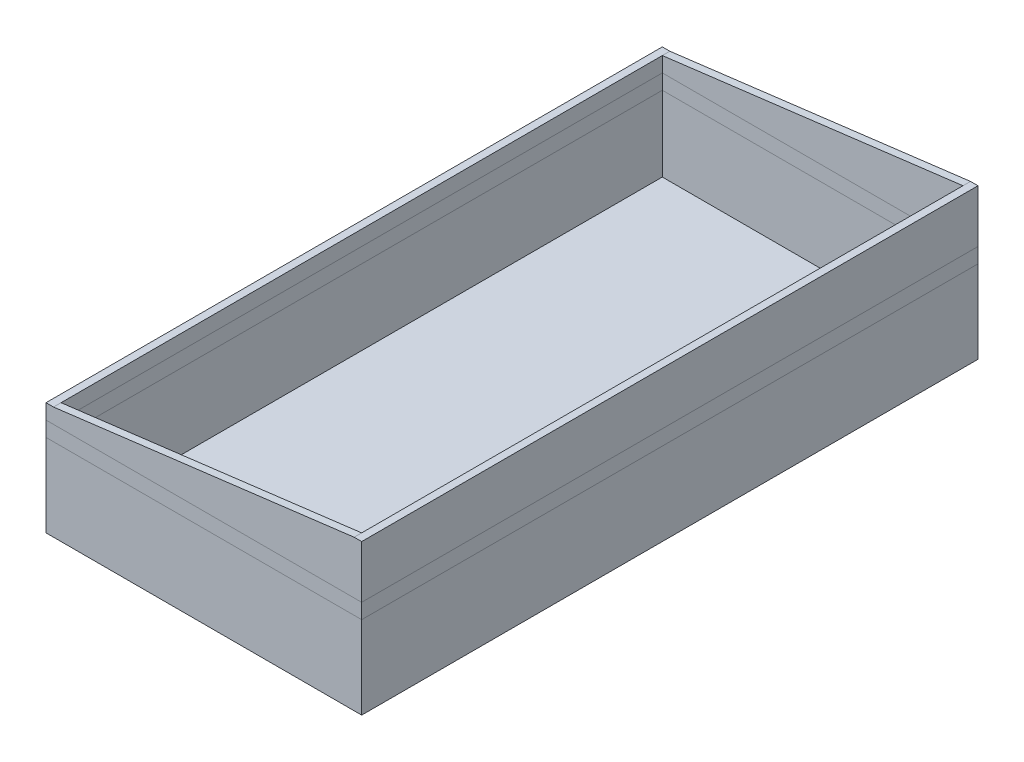
ISO-10303-21;
HEADER;
FILE_DESCRIPTION(('STEP AP214'),'2;1');
FILE_NAME('part.step','',(''),(''),'','','');
FILE_SCHEMA(('AUTOMOTIVE_DESIGN { 1 0 10303 214 1 1 1 1 }'));
ENDSEC;
DATA;
#1=APPLICATION_CONTEXT('core data for automotive mechanical design processes');
#2=APPLICATION_PROTOCOL_DEFINITION('international standard','automotive_design',2000,#1);
#3=PRODUCT_CONTEXT('',#1,'mechanical');
#4=PRODUCT('Part','Part','',(#3));
#5=PRODUCT_RELATED_PRODUCT_CATEGORY('part','',(#4));
#6=PRODUCT_DEFINITION_FORMATION('','',#4);
#7=PRODUCT_DEFINITION_CONTEXT('part definition',#1,'design');
#8=PRODUCT_DEFINITION('design','',#6,#7);
#9=PRODUCT_DEFINITION_SHAPE('','',#8);
#10=(LENGTH_UNIT() NAMED_UNIT(*) SI_UNIT(.MILLI.,.METRE.));
#11=(NAMED_UNIT(*) PLANE_ANGLE_UNIT() SI_UNIT($,.RADIAN.));
#12=(NAMED_UNIT(*) SI_UNIT($,.STERADIAN.) SOLID_ANGLE_UNIT());
#13=UNCERTAINTY_MEASURE_WITH_UNIT(LENGTH_MEASURE(1.E-05),#10,'distance_accuracy_value','');
#14=(GEOMETRIC_REPRESENTATION_CONTEXT(3) GLOBAL_UNCERTAINTY_ASSIGNED_CONTEXT((#13)) GLOBAL_UNIT_ASSIGNED_CONTEXT((#10,
#11,#12)) REPRESENTATION_CONTEXT('',''));
#15=CARTESIAN_POINT('',(0.,0.,0.));
#16=DIRECTION('',(0.,0.,1.));
#17=DIRECTION('',(1.,0.,0.));
#18=AXIS2_PLACEMENT_3D('',#15,#16,#17);
#19=CARTESIAN_POINT('',(-105.,0.,200.));
#20=DIRECTION('',(0.,0.,1.));
#21=DIRECTION('',(1.,0.,0.));
#22=AXIS2_PLACEMENT_3D('',#19,#20,#21);
#23=PLANE('',#22);
#24=DIRECTION('',(0.,1.,0.));
#25=VECTOR('',#24,1.);
#26=CARTESIAN_POINT('',(-100.,0.,200.));
#27=LINE('',#26,#25);
#28=CARTESIAN_POINT('',(-100.,65.,200.));
#29=VERTEX_POINT('',#28);
#30=CARTESIAN_POINT('',(-100.,75.,200.));
#31=VERTEX_POINT('',#30);
#32=EDGE_CURVE('P0_E20',#29,#31,#27,.T.);
#33=ORIENTED_EDGE('',*,*,#32,.T.);
#34=DIRECTION('',(0.992277876713668,0.124034734589208,0.));
#35=VECTOR('',#34,1.);
#36=CARTESIAN_POINT('',(100.,100.,200.));
#37=LINE('',#36,#35);
#38=CARTESIAN_POINT('',(100.,100.,200.));
#39=VERTEX_POINT('',#38);
#40=EDGE_CURVE('P0_E115',#31,#39,#37,.T.);
#41=ORIENTED_EDGE('',*,*,#40,.T.);
#42=DIRECTION('',(0.,1.,0.));
#43=VECTOR('',#42,1.);
#44=CARTESIAN_POINT('',(100.,0.,200.));
#45=LINE('',#44,#43);
#46=CARTESIAN_POINT('',(100.,65.,200.));
#47=VERTEX_POINT('',#46);
#48=EDGE_CURVE('P0_E133',#39,#47,#45,.F.);
#49=ORIENTED_EDGE('',*,*,#48,.T.);
#50=DIRECTION('',(1.,0.,0.));
#51=VECTOR('',#50,1.);
#52=CARTESIAN_POINT('',(-105.,65.,200.));
#53=LINE('',#52,#51);
#54=EDGE_CURVE('P0_E138',#29,#47,#53,.T.);
#55=ORIENTED_EDGE('',*,*,#54,.F.);
#56=EDGE_LOOP('',(#33,#41,#49,#55));
#57=FACE_BOUND('',#56,.T.);
#58=ADVANCED_FACE('P0_F17',(#57),#23,.F.);
#59=CARTESIAN_POINT('',(105.,0.,-200.));
#60=DIRECTION('',(0.,0.,-1.));
#61=DIRECTION('',(-1.,0.,0.));
#62=AXIS2_PLACEMENT_3D('',#59,#60,#61);
#63=PLANE('',#62);
#64=DIRECTION('',(0.,1.,0.));
#65=VECTOR('',#64,1.);
#66=CARTESIAN_POINT('',(100.,0.,-200.));
#67=LINE('',#66,#65);
#68=CARTESIAN_POINT('',(100.,65.,-200.));
#69=VERTEX_POINT('',#68);
#70=CARTESIAN_POINT('',(100.,100.,-200.));
#71=VERTEX_POINT('',#70);
#72=EDGE_CURVE('P0_E101',#69,#71,#67,.T.);
#73=ORIENTED_EDGE('',*,*,#72,.T.);
#74=DIRECTION('',(0.992277876713668,0.124034734589208,0.));
#75=VECTOR('',#74,1.);
#76=CARTESIAN_POINT('',(100.,100.,-200.));
#77=LINE('',#76,#75);
#78=CARTESIAN_POINT('',(-100.,75.,-200.));
#79=VERTEX_POINT('',#78);
#80=EDGE_CURVE('P0_E94',#71,#79,#77,.F.);
#81=ORIENTED_EDGE('',*,*,#80,.T.);
#82=DIRECTION('',(0.,1.,0.));
#83=VECTOR('',#82,1.);
#84=CARTESIAN_POINT('',(-100.,0.,-200.));
#85=LINE('',#84,#83);
#86=CARTESIAN_POINT('',(-100.,65.,-200.));
#87=VERTEX_POINT('',#86);
#88=EDGE_CURVE('P0_E99',#79,#87,#85,.F.);
#89=ORIENTED_EDGE('',*,*,#88,.T.);
#90=DIRECTION('',(1.,0.,0.));
#91=VECTOR('',#90,1.);
#92=CARTESIAN_POINT('',(-105.,65.,-200.));
#93=LINE('',#92,#91);
#94=EDGE_CURVE('P0_E145',#69,#87,#93,.F.);
#95=ORIENTED_EDGE('',*,*,#94,.F.);
#96=EDGE_LOOP('',(#73,#81,#89,#95));
#97=FACE_BOUND('',#96,.T.);
#98=ADVANCED_FACE('P0_F96',(#97),#63,.F.);
#99=CARTESIAN_POINT('',(-100.,0.,-205.));
#100=DIRECTION('',(-1.,0.,0.));
#101=DIRECTION('',(0.,0.,1.));
#102=AXIS2_PLACEMENT_3D('',#99,#100,#101);
#103=PLANE('',#102);
#104=ORIENTED_EDGE('',*,*,#88,.F.);
#105=DIRECTION('',(0.,0.,-1.));
#106=VECTOR('',#105,1.);
#107=CARTESIAN_POINT('',(-100.,75.,205.));
#108=LINE('',#107,#106);
#109=EDGE_CURVE('P0_E114',#79,#31,#108,.F.);
#110=ORIENTED_EDGE('',*,*,#109,.T.);
#111=ORIENTED_EDGE('',*,*,#32,.F.);
#112=DIRECTION('',(0.,0.,-1.));
#113=VECTOR('',#112,1.);
#114=CARTESIAN_POINT('',(-100.,65.,-205.001));
#115=LINE('',#114,#113);
#116=EDGE_CURVE('P0_E121',#87,#29,#115,.F.);
#117=ORIENTED_EDGE('',*,*,#116,.F.);
#118=EDGE_LOOP('',(#104,#110,#111,#117));
#119=FACE_BOUND('',#118,.T.);
#120=ADVANCED_FACE('P0_F118',(#119),#103,.F.);
#121=CARTESIAN_POINT('',(100.,100.,205.));
#122=DIRECTION('',(0.124034734589208,-0.992277876713668,0.));
#123=DIRECTION('',(0.992277876713668,0.124034734589208,0.));
#124=AXIS2_PLACEMENT_3D('',#121,#122,#123);
#125=PLANE('',#124);
#126=DIRECTION('',(0.,0.,-1.));
#127=VECTOR('',#126,1.);
#128=CARTESIAN_POINT('',(-100.,75.,205.));
#129=LINE('',#128,#127);
#130=CARTESIAN_POINT('',(-100.000000000001,75.,-205.));
#131=VERTEX_POINT('',#130);
#132=EDGE_CURVE('P0_E106',#131,#79,#129,.F.);
#133=ORIENTED_EDGE('',*,*,#132,.T.);
#134=ORIENTED_EDGE('',*,*,#80,.F.);
#135=DIRECTION('',(0.,0.,1.));
#136=VECTOR('',#135,1.);
#137=CARTESIAN_POINT('',(100.,100.,0.));
#138=LINE('',#137,#136);
#139=CARTESIAN_POINT('',(100.,100.,-205.));
#140=VERTEX_POINT('',#139);
#141=EDGE_CURVE('P0_E174',#140,#71,#138,.T.);
#142=ORIENTED_EDGE('',*,*,#141,.F.);
#143=DIRECTION('',(0.992277876713668,0.124034734589208,0.));
#144=VECTOR('',#143,1.);
#145=CARTESIAN_POINT('',(-100.,75.,-205.));
#146=LINE('',#145,#144);
#147=EDGE_CURVE('P0_E109',#131,#140,#146,.T.);
#148=ORIENTED_EDGE('',*,*,#147,.F.);
#149=EDGE_LOOP('',(#133,#134,#142,#148));
#150=FACE_BOUND('',#149,.T.);
#151=ADVANCED_FACE('P0_F107',(#150),#125,.F.);
#152=CARTESIAN_POINT('',(100.,0.,205.));
#153=DIRECTION('',(1.,0.,0.));
#154=DIRECTION('',(0.,0.,-1.));
#155=AXIS2_PLACEMENT_3D('',#152,#153,#154);
#156=PLANE('',#155);
#157=ORIENTED_EDGE('',*,*,#48,.F.);
#158=DIRECTION('',(0.,0.,1.));
#159=VECTOR('',#158,1.);
#160=CARTESIAN_POINT('',(100.,100.,0.));
#161=LINE('',#160,#159);
#162=EDGE_CURVE('P0_E177',#71,#39,#161,.T.);
#163=ORIENTED_EDGE('',*,*,#162,.F.);
#164=ORIENTED_EDGE('',*,*,#72,.F.);
#165=DIRECTION('',(0.,0.,-1.));
#166=VECTOR('',#165,1.);
#167=CARTESIAN_POINT('',(100.,65.,-205.001));
#168=LINE('',#167,#166);
#169=EDGE_CURVE('P0_E142',#47,#69,#168,.T.);
#170=ORIENTED_EDGE('',*,*,#169,.F.);
#171=EDGE_LOOP('',(#157,#163,#164,#170));
#172=FACE_BOUND('',#171,.T.);
#173=ADVANCED_FACE('P0_F143',(#172),#156,.F.);
#174=CARTESIAN_POINT('',(100.,100.,205.));
#175=DIRECTION('',(0.124034734589208,-0.992277876713668,0.));
#176=DIRECTION('',(0.992277876713668,0.124034734589208,0.));
#177=AXIS2_PLACEMENT_3D('',#174,#175,#176);
#178=PLANE('',#177);
#179=DIRECTION('',(0.,0.,-1.));
#180=VECTOR('',#179,1.);
#181=CARTESIAN_POINT('',(-100.,75.,205.));
#182=LINE('',#181,#180);
#183=CARTESIAN_POINT('',(-100.,75.,205.));
#184=VERTEX_POINT('',#183);
#185=EDGE_CURVE('P0_E126',#31,#184,#182,.F.);
#186=ORIENTED_EDGE('',*,*,#185,.T.);
#187=DIRECTION('',(-0.992277876713668,-0.124034734589208,0.));
#188=VECTOR('',#187,1.);
#189=CARTESIAN_POINT('',(100.,100.,205.));
#190=LINE('',#189,#188);
#191=CARTESIAN_POINT('',(100.000000000001,100.,205.));
#192=VERTEX_POINT('',#191);
#193=EDGE_CURVE('P0_E189',#192,#184,#190,.T.);
#194=ORIENTED_EDGE('',*,*,#193,.F.);
#195=DIRECTION('',(0.,0.,1.));
#196=VECTOR('',#195,1.);
#197=CARTESIAN_POINT('',(100.,100.,0.));
#198=LINE('',#197,#196);
#199=EDGE_CURVE('P0_E180',#39,#192,#198,.T.);
#200=ORIENTED_EDGE('',*,*,#199,.F.);
#201=ORIENTED_EDGE('',*,*,#40,.F.);
#202=EDGE_LOOP('',(#186,#194,#200,#201));
#203=FACE_BOUND('',#202,.T.);
#204=ADVANCED_FACE('P0_F210',(#203),#178,.F.);
#205=CARTESIAN_POINT('',(-100.,75.,205.));
#206=DIRECTION('',(0.,-1.,0.));
#207=DIRECTION('',(0.,0.,-1.));
#208=AXIS2_PLACEMENT_3D('',#205,#206,#207);
#209=PLANE('',#208);
#210=DIRECTION('',(0.,0.,1.));
#211=VECTOR('',#210,1.);
#212=CARTESIAN_POINT('',(-105.,75.,-205.));
#213=LINE('',#212,#211);
#214=CARTESIAN_POINT('',(-105.,75.,205.));
#215=VERTEX_POINT('',#214);
#216=CARTESIAN_POINT('',(-105.,75.,-205.));
#217=VERTEX_POINT('',#216);
#218=EDGE_CURVE('P0_E128',#215,#217,#213,.F.);
#219=ORIENTED_EDGE('',*,*,#218,.F.);
#220=DIRECTION('',(1.,0.,0.));
#221=VECTOR('',#220,1.);
#222=CARTESIAN_POINT('',(-105.,75.,205.));
#223=LINE('',#222,#221);
#224=EDGE_CURVE('P0_E192',#184,#215,#223,.F.);
#225=ORIENTED_EDGE('',*,*,#224,.F.);
#226=ORIENTED_EDGE('',*,*,#185,.F.);
#227=ORIENTED_EDGE('',*,*,#109,.F.);
#228=ORIENTED_EDGE('',*,*,#132,.F.);
#229=DIRECTION('',(-1.,0.,0.));
#230=VECTOR('',#229,1.);
#231=CARTESIAN_POINT('',(105.,75.,-205.));
#232=LINE('',#231,#230);
#233=EDGE_CURVE('P0_E163',#217,#131,#232,.F.);
#234=ORIENTED_EDGE('',*,*,#233,.F.);
#235=EDGE_LOOP('',(#219,#225,#226,#227,#228,#234));
#236=FACE_BOUND('',#235,.T.);
#237=ADVANCED_FACE('P0_F124',(#236),#209,.F.);
#238=CARTESIAN_POINT('',(-105.,0.,-205.));
#239=DIRECTION('',(-1.,0.,0.));
#240=DIRECTION('',(0.,0.,1.));
#241=AXIS2_PLACEMENT_3D('',#238,#239,#240);
#242=PLANE('',#241);
#243=ORIENTED_EDGE('',*,*,#218,.T.);
#244=DIRECTION('',(0.,1.,0.));
#245=VECTOR('',#244,1.);
#246=CARTESIAN_POINT('',(-105.,0.,-205.));
#247=LINE('',#246,#245);
#248=CARTESIAN_POINT('',(-105.,65.,-205.));
#249=VERTEX_POINT('',#248);
#250=EDGE_CURVE('P0_E158',#249,#217,#247,.T.);
#251=ORIENTED_EDGE('',*,*,#250,.F.);
#252=DIRECTION('',(0.,0.,-1.));
#253=VECTOR('',#252,1.);
#254=CARTESIAN_POINT('',(-105.,65.,-205.001));
#255=LINE('',#254,#253);
#256=CARTESIAN_POINT('',(-105.,65.,205.));
#257=VERTEX_POINT('',#256);
#258=EDGE_CURVE('P0_E149',#257,#249,#255,.T.);
#259=ORIENTED_EDGE('',*,*,#258,.F.);
#260=DIRECTION('',(0.,1.,0.));
#261=VECTOR('',#260,1.);
#262=CARTESIAN_POINT('',(-105.,0.,205.));
#263=LINE('',#262,#261);
#264=EDGE_CURVE('P0_E161',#215,#257,#263,.F.);
#265=ORIENTED_EDGE('',*,*,#264,.F.);
#266=EDGE_LOOP('',(#243,#251,#259,#265));
#267=FACE_BOUND('',#266,.T.);
#268=ADVANCED_FACE('P0_F156',(#267),#242,.T.);
#269=CARTESIAN_POINT('',(-105.,65.,-205.001));
#270=DIRECTION('',(0.,-1.,0.));
#271=DIRECTION('',(0.,0.,-1.));
#272=AXIS2_PLACEMENT_3D('',#269,#270,#271);
#273=PLANE('',#272);
#274=ORIENTED_EDGE('',*,*,#94,.T.);
#275=ORIENTED_EDGE('',*,*,#116,.T.);
#276=ORIENTED_EDGE('',*,*,#54,.T.);
#277=ORIENTED_EDGE('',*,*,#169,.T.);
#278=EDGE_LOOP('',(#274,#275,#276,#277));
#279=FACE_BOUND('',#278,.T.);
#280=DIRECTION('',(1.,0.,0.));
#281=VECTOR('',#280,1.);
#282=CARTESIAN_POINT('',(-105.,65.,205.));
#283=LINE('',#282,#281);
#284=CARTESIAN_POINT('',(105.,65.,205.));
#285=VERTEX_POINT('',#284);
#286=EDGE_CURVE('P0_E185',#257,#285,#283,.T.);
#287=ORIENTED_EDGE('',*,*,#286,.F.);
#288=ORIENTED_EDGE('',*,*,#258,.T.);
#289=DIRECTION('',(-1.,0.,0.));
#290=VECTOR('',#289,1.);
#291=CARTESIAN_POINT('',(105.,65.,-205.));
#292=LINE('',#291,#290);
#293=CARTESIAN_POINT('',(105.,65.,-205.));
#294=VERTEX_POINT('',#293);
#295=EDGE_CURVE('P0_E168',#294,#249,#292,.T.);
#296=ORIENTED_EDGE('',*,*,#295,.F.);
#297=DIRECTION('',(0.,0.,-1.));
#298=VECTOR('',#297,1.);
#299=CARTESIAN_POINT('',(105.,65.,205.));
#300=LINE('',#299,#298);
#301=EDGE_CURVE('P0_E195',#285,#294,#300,.T.);
#302=ORIENTED_EDGE('',*,*,#301,.F.);
#303=EDGE_LOOP('',(#287,#288,#296,#302));
#304=FACE_BOUND('',#303,.T.);
#305=ADVANCED_FACE('P0_F147',(#279,#304),#273,.T.);
#306=CARTESIAN_POINT('',(105.,0.,-205.));
#307=DIRECTION('',(0.,0.,-1.));
#308=DIRECTION('',(-1.,0.,0.));
#309=AXIS2_PLACEMENT_3D('',#306,#307,#308);
#310=PLANE('',#309);
#311=DIRECTION('',(1.,0.,0.));
#312=VECTOR('',#311,1.);
#313=CARTESIAN_POINT('',(0.,100.,-205.));
#314=LINE('',#313,#312);
#315=CARTESIAN_POINT('',(105.,100.,-205.));
#316=VERTEX_POINT('',#315);
#317=EDGE_CURVE('P0_E182',#316,#140,#314,.F.);
#318=ORIENTED_EDGE('',*,*,#317,.F.);
#319=DIRECTION('',(0.,1.,0.));
#320=VECTOR('',#319,1.);
#321=CARTESIAN_POINT('',(105.,0.,-205.));
#322=LINE('',#321,#320);
#323=EDGE_CURVE('P0_E198',#294,#316,#322,.T.);
#324=ORIENTED_EDGE('',*,*,#323,.F.);
#325=ORIENTED_EDGE('',*,*,#295,.T.);
#326=ORIENTED_EDGE('',*,*,#250,.T.);
#327=ORIENTED_EDGE('',*,*,#233,.T.);
#328=ORIENTED_EDGE('',*,*,#147,.T.);
#329=EDGE_LOOP('',(#318,#324,#325,#326,#327,#328));
#330=FACE_BOUND('',#329,.T.);
#331=ADVANCED_FACE('P0_F166',(#330),#310,.T.);
#332=CARTESIAN_POINT('',(0.,100.,0.));
#333=DIRECTION('',(0.,1.,0.));
#334=DIRECTION('',(0.,0.,1.));
#335=AXIS2_PLACEMENT_3D('',#332,#333,#334);
#336=PLANE('',#335);
#337=DIRECTION('',(0.,0.,-1.));
#338=VECTOR('',#337,1.);
#339=CARTESIAN_POINT('',(105.,100.,205.));
#340=LINE('',#339,#338);
#341=CARTESIAN_POINT('',(105.,100.,205.));
#342=VERTEX_POINT('',#341);
#343=EDGE_CURVE('P0_E26',#316,#342,#340,.F.);
#344=ORIENTED_EDGE('',*,*,#343,.F.);
#345=ORIENTED_EDGE('',*,*,#317,.T.);
#346=ORIENTED_EDGE('',*,*,#141,.T.);
#347=ORIENTED_EDGE('',*,*,#162,.T.);
#348=ORIENTED_EDGE('',*,*,#199,.T.);
#349=DIRECTION('',(1.,0.,0.));
#350=VECTOR('',#349,1.);
#351=CARTESIAN_POINT('',(-105.,100.,205.));
#352=LINE('',#351,#350);
#353=EDGE_CURVE('P0_E35',#342,#192,#352,.F.);
#354=ORIENTED_EDGE('',*,*,#353,.F.);
#355=EDGE_LOOP('',(#344,#345,#346,#347,#348,#354));
#356=FACE_BOUND('',#355,.T.);
#357=ADVANCED_FACE('P0_F204',(#356),#336,.T.);
#358=CARTESIAN_POINT('',(-105.,0.,205.));
#359=DIRECTION('',(0.,0.,1.));
#360=DIRECTION('',(1.,0.,0.));
#361=AXIS2_PLACEMENT_3D('',#358,#359,#360);
#362=PLANE('',#361);
#363=ORIENTED_EDGE('',*,*,#224,.T.);
#364=ORIENTED_EDGE('',*,*,#264,.T.);
#365=ORIENTED_EDGE('',*,*,#286,.T.);
#366=DIRECTION('',(0.,1.,0.));
#367=VECTOR('',#366,1.);
#368=CARTESIAN_POINT('',(105.,0.,205.));
#369=LINE('',#368,#367);
#370=EDGE_CURVE('P0_E11',#342,#285,#369,.F.);
#371=ORIENTED_EDGE('',*,*,#370,.F.);
#372=ORIENTED_EDGE('',*,*,#353,.T.);
#373=ORIENTED_EDGE('',*,*,#193,.T.);
#374=EDGE_LOOP('',(#363,#364,#365,#371,#372,#373));
#375=FACE_BOUND('',#374,.T.);
#376=ADVANCED_FACE('P0_F207',(#375),#362,.T.);
#377=CARTESIAN_POINT('',(105.,0.,205.));
#378=DIRECTION('',(1.,0.,0.));
#379=DIRECTION('',(0.,0.,-1.));
#380=AXIS2_PLACEMENT_3D('',#377,#378,#379);
#381=PLANE('',#380);
#382=ORIENTED_EDGE('',*,*,#343,.T.);
#383=ORIENTED_EDGE('',*,*,#370,.T.);
#384=ORIENTED_EDGE('',*,*,#301,.T.);
#385=ORIENTED_EDGE('',*,*,#323,.T.);
#386=EDGE_LOOP('',(#382,#383,#384,#385));
#387=FACE_BOUND('',#386,.T.);
#388=ADVANCED_FACE('P0_F203',(#387),#381,.T.);
#389=CLOSED_SHELL('',(#58,#98,#120,#151,#173,#204,#237,#268,#305,#331,#357,#376,#388));
#390=MANIFOLD_SOLID_BREP('P0_B1',#389);
#391=CARTESIAN_POINT('',(-105.,65.,-205.001));
#392=DIRECTION('',(0.,-1.,0.));
#393=DIRECTION('',(0.,0.,-1.));
#394=AXIS2_PLACEMENT_3D('',#391,#392,#393);
#395=PLANE('',#394);
#396=DIRECTION('',(0.,0.,1.));
#397=VECTOR('',#396,1.);
#398=CARTESIAN_POINT('',(-100.,65.,-205.));
#399=LINE('',#398,#397);
#400=CARTESIAN_POINT('',(-100.,65.,200.));
#401=VERTEX_POINT('',#400);
#402=CARTESIAN_POINT('',(-100.,65.,-200.));
#403=VERTEX_POINT('',#402);
#404=EDGE_CURVE('P1_E123',#401,#403,#399,.F.);
#405=ORIENTED_EDGE('',*,*,#404,.T.);
#406=DIRECTION('',(-1.,0.,0.));
#407=VECTOR('',#406,1.);
#408=CARTESIAN_POINT('',(105.,65.,-200.));
#409=LINE('',#408,#407);
#410=CARTESIAN_POINT('',(100.,65.,-200.));
#411=VERTEX_POINT('',#410);
#412=EDGE_CURVE('P1_E116',#403,#411,#409,.F.);
#413=ORIENTED_EDGE('',*,*,#412,.T.);
#414=DIRECTION('',(0.,0.,-1.));
#415=VECTOR('',#414,1.);
#416=CARTESIAN_POINT('',(100.,65.,205.));
#417=LINE('',#416,#415);
#418=CARTESIAN_POINT('',(100.,65.,200.));
#419=VERTEX_POINT('',#418);
#420=EDGE_CURVE('P1_E112',#411,#419,#417,.F.);
#421=ORIENTED_EDGE('',*,*,#420,.T.);
#422=DIRECTION('',(1.,0.,0.));
#423=VECTOR('',#422,1.);
#424=CARTESIAN_POINT('',(-105.,65.,200.));
#425=LINE('',#424,#423);
#426=EDGE_CURVE('P1_E110',#419,#401,#425,.F.);
#427=ORIENTED_EDGE('',*,*,#426,.T.);
#428=EDGE_LOOP('',(#405,#413,#421,#427));
#429=FACE_BOUND('',#428,.T.);
#430=DIRECTION('',(0.,0.,1.));
#431=VECTOR('',#430,1.);
#432=CARTESIAN_POINT('',(-105.,65.,-205.));
#433=LINE('',#432,#431);
#434=CARTESIAN_POINT('',(-105.,65.,205.));
#435=VERTEX_POINT('',#434);
#436=CARTESIAN_POINT('',(-105.,65.,-205.));
#437=VERTEX_POINT('',#436);
#438=EDGE_CURVE('P1_E107',#435,#437,#433,.F.);
#439=ORIENTED_EDGE('',*,*,#438,.F.);
#440=DIRECTION('',(1.,0.,0.));
#441=VECTOR('',#440,1.);
#442=CARTESIAN_POINT('',(-105.,65.,205.));
#443=LINE('',#442,#441);
#444=CARTESIAN_POINT('',(105.,65.,205.));
#445=VERTEX_POINT('',#444);
#446=EDGE_CURVE('P1_E93',#445,#435,#443,.F.);
#447=ORIENTED_EDGE('',*,*,#446,.F.);
#448=DIRECTION('',(0.,0.,-1.));
#449=VECTOR('',#448,1.);
#450=CARTESIAN_POINT('',(105.,65.,205.));
#451=LINE('',#450,#449);
#452=CARTESIAN_POINT('',(105.,65.,-205.));
#453=VERTEX_POINT('',#452);
#454=EDGE_CURVE('P1_E80',#453,#445,#451,.F.);
#455=ORIENTED_EDGE('',*,*,#454,.F.);
#456=DIRECTION('',(-1.,0.,0.));
#457=VECTOR('',#456,1.);
#458=CARTESIAN_POINT('',(105.,65.,-205.));
#459=LINE('',#458,#457);
#460=EDGE_CURVE('P1_E20',#437,#453,#459,.F.);
#461=ORIENTED_EDGE('',*,*,#460,.F.);
#462=EDGE_LOOP('',(#439,#447,#455,#461));
#463=FACE_BOUND('',#462,.T.);
#464=ADVANCED_FACE('P1_F17',(#429,#463),#395,.F.);
#465=CARTESIAN_POINT('',(105.,0.,-205.));
#466=DIRECTION('',(0.,0.,-1.));
#467=DIRECTION('',(-1.,0.,0.));
#468=AXIS2_PLACEMENT_3D('',#465,#466,#467);
#469=PLANE('',#468);
#470=ORIENTED_EDGE('',*,*,#460,.T.);
#471=DIRECTION('',(0.,1.,0.));
#472=VECTOR('',#471,1.);
#473=CARTESIAN_POINT('',(105.,0.,-205.));
#474=LINE('',#473,#472);
#475=CARTESIAN_POINT('',(105.,55.,-205.));
#476=VERTEX_POINT('',#475);
#477=EDGE_CURVE('P1_E86',#476,#453,#474,.T.);
#478=ORIENTED_EDGE('',*,*,#477,.F.);
#479=DIRECTION('',(1.,0.,0.));
#480=VECTOR('',#479,1.);
#481=CARTESIAN_POINT('',(-105.,55.,-205.));
#482=LINE('',#481,#480);
#483=CARTESIAN_POINT('',(-105.,55.,-205.));
#484=VERTEX_POINT('',#483);
#485=EDGE_CURVE('P1_E126',#484,#476,#482,.T.);
#486=ORIENTED_EDGE('',*,*,#485,.F.);
#487=DIRECTION('',(0.,1.,0.));
#488=VECTOR('',#487,1.);
#489=CARTESIAN_POINT('',(-105.,0.,-205.));
#490=LINE('',#489,#488);
#491=EDGE_CURVE('P1_E89',#437,#484,#490,.F.);
#492=ORIENTED_EDGE('',*,*,#491,.F.);
#493=EDGE_LOOP('',(#470,#478,#486,#492));
#494=FACE_BOUND('',#493,.T.);
#495=ADVANCED_FACE('P1_F85',(#494),#469,.T.);
#496=CARTESIAN_POINT('',(105.,0.,205.));
#497=DIRECTION('',(1.,0.,0.));
#498=DIRECTION('',(0.,0.,-1.));
#499=AXIS2_PLACEMENT_3D('',#496,#497,#498);
#500=PLANE('',#499);
#501=ORIENTED_EDGE('',*,*,#454,.T.);
#502=DIRECTION('',(0.,1.,0.));
#503=VECTOR('',#502,1.);
#504=CARTESIAN_POINT('',(105.,0.,205.));
#505=LINE('',#504,#503);
#506=CARTESIAN_POINT('',(105.,55.,205.));
#507=VERTEX_POINT('',#506);
#508=EDGE_CURVE('P1_E95',#507,#445,#505,.T.);
#509=ORIENTED_EDGE('',*,*,#508,.F.);
#510=DIRECTION('',(0.,0.,-1.));
#511=VECTOR('',#510,1.);
#512=CARTESIAN_POINT('',(105.,55.,-205.001));
#513=LINE('',#512,#511);
#514=EDGE_CURVE('P1_E99',#476,#507,#513,.F.);
#515=ORIENTED_EDGE('',*,*,#514,.F.);
#516=ORIENTED_EDGE('',*,*,#477,.T.);
#517=EDGE_LOOP('',(#501,#509,#515,#516));
#518=FACE_BOUND('',#517,.T.);
#519=ADVANCED_FACE('P1_F97',(#518),#500,.T.);
#520=CARTESIAN_POINT('',(-105.,0.,205.));
#521=DIRECTION('',(0.,0.,1.));
#522=DIRECTION('',(1.,0.,0.));
#523=AXIS2_PLACEMENT_3D('',#520,#521,#522);
#524=PLANE('',#523);
#525=ORIENTED_EDGE('',*,*,#446,.T.);
#526=DIRECTION('',(0.,1.,0.));
#527=VECTOR('',#526,1.);
#528=CARTESIAN_POINT('',(-105.,0.,205.));
#529=LINE('',#528,#527);
#530=CARTESIAN_POINT('',(-105.,55.,205.));
#531=VERTEX_POINT('',#530);
#532=EDGE_CURVE('P1_E104',#531,#435,#529,.T.);
#533=ORIENTED_EDGE('',*,*,#532,.F.);
#534=DIRECTION('',(1.,0.,0.));
#535=VECTOR('',#534,1.);
#536=CARTESIAN_POINT('',(-105.,55.,205.));
#537=LINE('',#536,#535);
#538=EDGE_CURVE('P1_E129',#507,#531,#537,.F.);
#539=ORIENTED_EDGE('',*,*,#538,.F.);
#540=ORIENTED_EDGE('',*,*,#508,.T.);
#541=EDGE_LOOP('',(#525,#533,#539,#540));
#542=FACE_BOUND('',#541,.T.);
#543=ADVANCED_FACE('P1_F177',(#542),#524,.T.);
#544=CARTESIAN_POINT('',(-105.,0.,-205.));
#545=DIRECTION('',(-1.,0.,0.));
#546=DIRECTION('',(0.,0.,1.));
#547=AXIS2_PLACEMENT_3D('',#544,#545,#546);
#548=PLANE('',#547);
#549=ORIENTED_EDGE('',*,*,#438,.T.);
#550=ORIENTED_EDGE('',*,*,#491,.T.);
#551=DIRECTION('',(0.,0.,-1.));
#552=VECTOR('',#551,1.);
#553=CARTESIAN_POINT('',(-105.,55.,-205.001));
#554=LINE('',#553,#552);
#555=EDGE_CURVE('P1_E132',#531,#484,#554,.T.);
#556=ORIENTED_EDGE('',*,*,#555,.F.);
#557=ORIENTED_EDGE('',*,*,#532,.T.);
#558=EDGE_LOOP('',(#549,#550,#556,#557));
#559=FACE_BOUND('',#558,.T.);
#560=ADVANCED_FACE('P1_F174',(#559),#548,.T.);
#561=CARTESIAN_POINT('',(-105.,0.,200.));
#562=DIRECTION('',(0.,0.,1.));
#563=DIRECTION('',(1.,0.,0.));
#564=AXIS2_PLACEMENT_3D('',#561,#562,#563);
#565=PLANE('',#564);
#566=DIRECTION('',(0.,1.,0.));
#567=VECTOR('',#566,1.);
#568=CARTESIAN_POINT('',(-100.,0.,200.));
#569=LINE('',#568,#567);
#570=CARTESIAN_POINT('',(-100.,55.,200.));
#571=VERTEX_POINT('',#570);
#572=EDGE_CURVE('P1_E120',#571,#401,#569,.T.);
#573=ORIENTED_EDGE('',*,*,#572,.T.);
#574=ORIENTED_EDGE('',*,*,#426,.F.);
#575=DIRECTION('',(0.,1.,0.));
#576=VECTOR('',#575,1.);
#577=CARTESIAN_POINT('',(100.,0.,200.));
#578=LINE('',#577,#576);
#579=CARTESIAN_POINT('',(100.,55.,200.));
#580=VERTEX_POINT('',#579);
#581=EDGE_CURVE('P1_E114',#419,#580,#578,.F.);
#582=ORIENTED_EDGE('',*,*,#581,.T.);
#583=DIRECTION('',(1.,0.,0.));
#584=VECTOR('',#583,1.);
#585=CARTESIAN_POINT('',(-105.,55.,200.));
#586=LINE('',#585,#584);
#587=EDGE_CURVE('P1_E135',#571,#580,#586,.T.);
#588=ORIENTED_EDGE('',*,*,#587,.F.);
#589=EDGE_LOOP('',(#573,#574,#582,#588));
#590=FACE_BOUND('',#589,.T.);
#591=ADVANCED_FACE('P1_F155',(#590),#565,.F.);
#592=CARTESIAN_POINT('',(100.,0.,205.));
#593=DIRECTION('',(1.,0.,0.));
#594=DIRECTION('',(0.,0.,-1.));
#595=AXIS2_PLACEMENT_3D('',#592,#593,#594);
#596=PLANE('',#595);
#597=ORIENTED_EDGE('',*,*,#581,.F.);
#598=ORIENTED_EDGE('',*,*,#420,.F.);
#599=DIRECTION('',(0.,1.,0.));
#600=VECTOR('',#599,1.);
#601=CARTESIAN_POINT('',(100.,0.,-200.));
#602=LINE('',#601,#600);
#603=CARTESIAN_POINT('',(100.,55.,-200.));
#604=VERTEX_POINT('',#603);
#605=EDGE_CURVE('P1_E118',#411,#604,#602,.F.);
#606=ORIENTED_EDGE('',*,*,#605,.T.);
#607=DIRECTION('',(0.,0.,-1.));
#608=VECTOR('',#607,1.);
#609=CARTESIAN_POINT('',(100.,55.,-205.001));
#610=LINE('',#609,#608);
#611=EDGE_CURVE('P1_E138',#580,#604,#610,.T.);
#612=ORIENTED_EDGE('',*,*,#611,.F.);
#613=EDGE_LOOP('',(#597,#598,#606,#612));
#614=FACE_BOUND('',#613,.T.);
#615=ADVANCED_FACE('P1_F151',(#614),#596,.F.);
#616=CARTESIAN_POINT('',(105.,0.,-200.));
#617=DIRECTION('',(0.,0.,-1.));
#618=DIRECTION('',(-1.,0.,0.));
#619=AXIS2_PLACEMENT_3D('',#616,#617,#618);
#620=PLANE('',#619);
#621=ORIENTED_EDGE('',*,*,#605,.F.);
#622=ORIENTED_EDGE('',*,*,#412,.F.);
#623=DIRECTION('',(0.,1.,0.));
#624=VECTOR('',#623,1.);
#625=CARTESIAN_POINT('',(-100.,0.,-200.));
#626=LINE('',#625,#624);
#627=CARTESIAN_POINT('',(-100.,55.,-200.));
#628=VERTEX_POINT('',#627);
#629=EDGE_CURVE('P1_E35',#403,#628,#626,.F.);
#630=ORIENTED_EDGE('',*,*,#629,.T.);
#631=DIRECTION('',(1.,0.,0.));
#632=VECTOR('',#631,1.);
#633=CARTESIAN_POINT('',(-105.,55.,-200.));
#634=LINE('',#633,#632);
#635=EDGE_CURVE('P1_E26',#604,#628,#634,.F.);
#636=ORIENTED_EDGE('',*,*,#635,.F.);
#637=EDGE_LOOP('',(#621,#622,#630,#636));
#638=FACE_BOUND('',#637,.T.);
#639=ADVANCED_FACE('P1_F147',(#638),#620,.F.);
#640=CARTESIAN_POINT('',(-100.,0.,-205.));
#641=DIRECTION('',(-1.,0.,0.));
#642=DIRECTION('',(0.,0.,1.));
#643=AXIS2_PLACEMENT_3D('',#640,#641,#642);
#644=PLANE('',#643);
#645=ORIENTED_EDGE('',*,*,#629,.F.);
#646=ORIENTED_EDGE('',*,*,#404,.F.);
#647=ORIENTED_EDGE('',*,*,#572,.F.);
#648=DIRECTION('',(0.,0.,-1.));
#649=VECTOR('',#648,1.);
#650=CARTESIAN_POINT('',(-100.,55.,-205.001));
#651=LINE('',#650,#649);
#652=EDGE_CURVE('P1_E11',#628,#571,#651,.F.);
#653=ORIENTED_EDGE('',*,*,#652,.F.);
#654=EDGE_LOOP('',(#645,#646,#647,#653));
#655=FACE_BOUND('',#654,.T.);
#656=ADVANCED_FACE('P1_F159',(#655),#644,.F.);
#657=CARTESIAN_POINT('',(-105.,55.,-205.001));
#658=DIRECTION('',(0.,-1.,0.));
#659=DIRECTION('',(0.,0.,-1.));
#660=AXIS2_PLACEMENT_3D('',#657,#658,#659);
#661=PLANE('',#660);
#662=ORIENTED_EDGE('',*,*,#635,.T.);
#663=ORIENTED_EDGE('',*,*,#652,.T.);
#664=ORIENTED_EDGE('',*,*,#587,.T.);
#665=ORIENTED_EDGE('',*,*,#611,.T.);
#666=EDGE_LOOP('',(#662,#663,#664,#665));
#667=FACE_BOUND('',#666,.T.);
#668=ORIENTED_EDGE('',*,*,#538,.T.);
#669=ORIENTED_EDGE('',*,*,#555,.T.);
#670=ORIENTED_EDGE('',*,*,#485,.T.);
#671=ORIENTED_EDGE('',*,*,#514,.T.);
#672=EDGE_LOOP('',(#668,#669,#670,#671));
#673=FACE_BOUND('',#672,.T.);
#674=ADVANCED_FACE('P1_F143',(#667,#673),#661,.T.);
#675=CLOSED_SHELL('',(#464,#495,#519,#543,#560,#591,#615,#639,#656,#674));
#676=MANIFOLD_SOLID_BREP('P1_B1',#675);
#677=CARTESIAN_POINT('',(0.,5.,0.));
#678=DIRECTION('',(0.,1.,0.));
#679=DIRECTION('',(0.,0.,1.));
#680=AXIS2_PLACEMENT_3D('',#677,#678,#679);
#681=PLANE('',#680);
#682=DIRECTION('',(-1.,0.,0.));
#683=VECTOR('',#682,1.);
#684=CARTESIAN_POINT('',(105.,5.,-200.));
#685=LINE('',#684,#683);
#686=CARTESIAN_POINT('',(100.,5.,-200.));
#687=VERTEX_POINT('',#686);
#688=CARTESIAN_POINT('',(-100.,5.,-200.));
#689=VERTEX_POINT('',#688);
#690=EDGE_CURVE('P2_E78',#687,#689,#685,.T.);
#691=ORIENTED_EDGE('',*,*,#690,.T.);
#692=DIRECTION('',(0.,0.,1.));
#693=VECTOR('',#692,1.);
#694=CARTESIAN_POINT('',(-100.,5.,-205.));
#695=LINE('',#694,#693);
#696=CARTESIAN_POINT('',(-100.,5.,200.));
#697=VERTEX_POINT('',#696);
#698=EDGE_CURVE('P2_E100',#689,#697,#695,.T.);
#699=ORIENTED_EDGE('',*,*,#698,.T.);
#700=DIRECTION('',(1.,0.,0.));
#701=VECTOR('',#700,1.);
#702=CARTESIAN_POINT('',(-105.,5.,200.));
#703=LINE('',#702,#701);
#704=CARTESIAN_POINT('',(100.,5.,200.));
#705=VERTEX_POINT('',#704);
#706=EDGE_CURVE('P2_E82',#697,#705,#703,.T.);
#707=ORIENTED_EDGE('',*,*,#706,.T.);
#708=DIRECTION('',(0.,0.,-1.));
#709=VECTOR('',#708,1.);
#710=CARTESIAN_POINT('',(100.,5.,205.));
#711=LINE('',#710,#709);
#712=EDGE_CURVE('P2_E20',#705,#687,#711,.T.);
#713=ORIENTED_EDGE('',*,*,#712,.T.);
#714=EDGE_LOOP('',(#691,#699,#707,#713));
#715=FACE_BOUND('',#714,.T.);
#716=ADVANCED_FACE('P2_F17',(#715),#681,.T.);
#717=CARTESIAN_POINT('',(100.,0.,205.));
#718=DIRECTION('',(1.,0.,0.));
#719=DIRECTION('',(0.,0.,-1.));
#720=AXIS2_PLACEMENT_3D('',#717,#718,#719);
#721=PLANE('',#720);
#722=DIRECTION('',(0.,1.,0.));
#723=VECTOR('',#722,1.);
#724=CARTESIAN_POINT('',(100.,0.,-200.));
#725=LINE('',#724,#723);
#726=CARTESIAN_POINT('',(100.,55.,-200.));
#727=VERTEX_POINT('',#726);
#728=EDGE_CURVE('P2_E87',#727,#687,#725,.F.);
#729=ORIENTED_EDGE('',*,*,#728,.T.);
#730=ORIENTED_EDGE('',*,*,#712,.F.);
#731=DIRECTION('',(0.,1.,0.));
#732=VECTOR('',#731,1.);
#733=CARTESIAN_POINT('',(100.,0.,200.));
#734=LINE('',#733,#732);
#735=CARTESIAN_POINT('',(100.,55.,200.));
#736=VERTEX_POINT('',#735);
#737=EDGE_CURVE('P2_E106',#705,#736,#734,.T.);
#738=ORIENTED_EDGE('',*,*,#737,.T.);
#739=DIRECTION('',(0.,0.,-1.));
#740=VECTOR('',#739,1.);
#741=CARTESIAN_POINT('',(100.,55.,-205.001));
#742=LINE('',#741,#740);
#743=EDGE_CURVE('P2_E97',#736,#727,#742,.T.);
#744=ORIENTED_EDGE('',*,*,#743,.T.);
#745=EDGE_LOOP('',(#729,#730,#738,#744));
#746=FACE_BOUND('',#745,.T.);
#747=ADVANCED_FACE('P2_F96',(#746),#721,.F.);
#748=CARTESIAN_POINT('',(105.,0.,-200.));
#749=DIRECTION('',(0.,0.,-1.));
#750=DIRECTION('',(-1.,0.,0.));
#751=AXIS2_PLACEMENT_3D('',#748,#749,#750);
#752=PLANE('',#751);
#753=DIRECTION('',(0.,1.,0.));
#754=VECTOR('',#753,1.);
#755=CARTESIAN_POINT('',(-100.,0.,-200.));
#756=LINE('',#755,#754);
#757=CARTESIAN_POINT('',(-100.,55.,-200.));
#758=VERTEX_POINT('',#757);
#759=EDGE_CURVE('P2_E93',#758,#689,#756,.F.);
#760=ORIENTED_EDGE('',*,*,#759,.T.);
#761=ORIENTED_EDGE('',*,*,#690,.F.);
#762=ORIENTED_EDGE('',*,*,#728,.F.);
#763=DIRECTION('',(1.,0.,0.));
#764=VECTOR('',#763,1.);
#765=CARTESIAN_POINT('',(-105.,55.,-200.));
#766=LINE('',#765,#764);
#767=EDGE_CURVE('P2_E109',#727,#758,#766,.F.);
#768=ORIENTED_EDGE('',*,*,#767,.T.);
#769=EDGE_LOOP('',(#760,#761,#762,#768));
#770=FACE_BOUND('',#769,.T.);
#771=ADVANCED_FACE('P2_F90',(#770),#752,.F.);
#772=CARTESIAN_POINT('',(-100.,0.,-205.));
#773=DIRECTION('',(-1.,0.,0.));
#774=DIRECTION('',(0.,0.,1.));
#775=AXIS2_PLACEMENT_3D('',#772,#773,#774);
#776=PLANE('',#775);
#777=DIRECTION('',(0.,1.,0.));
#778=VECTOR('',#777,1.);
#779=CARTESIAN_POINT('',(-100.,0.,200.));
#780=LINE('',#779,#778);
#781=CARTESIAN_POINT('',(-100.,55.,200.));
#782=VERTEX_POINT('',#781);
#783=EDGE_CURVE('P2_E102',#782,#697,#780,.F.);
#784=ORIENTED_EDGE('',*,*,#783,.T.);
#785=ORIENTED_EDGE('',*,*,#698,.F.);
#786=ORIENTED_EDGE('',*,*,#759,.F.);
#787=DIRECTION('',(0.,0.,-1.));
#788=VECTOR('',#787,1.);
#789=CARTESIAN_POINT('',(-100.,55.,-205.001));
#790=LINE('',#789,#788);
#791=EDGE_CURVE('P2_E111',#758,#782,#790,.F.);
#792=ORIENTED_EDGE('',*,*,#791,.T.);
#793=EDGE_LOOP('',(#784,#785,#786,#792));
#794=FACE_BOUND('',#793,.T.);
#795=ADVANCED_FACE('P2_F178',(#794),#776,.F.);
#796=CARTESIAN_POINT('',(-105.,0.,200.));
#797=DIRECTION('',(0.,0.,1.));
#798=DIRECTION('',(1.,0.,0.));
#799=AXIS2_PLACEMENT_3D('',#796,#797,#798);
#800=PLANE('',#799);
#801=ORIENTED_EDGE('',*,*,#737,.F.);
#802=ORIENTED_EDGE('',*,*,#706,.F.);
#803=ORIENTED_EDGE('',*,*,#783,.F.);
#804=DIRECTION('',(1.,0.,0.));
#805=VECTOR('',#804,1.);
#806=CARTESIAN_POINT('',(-105.,55.,200.));
#807=LINE('',#806,#805);
#808=EDGE_CURVE('P2_E114',#782,#736,#807,.T.);
#809=ORIENTED_EDGE('',*,*,#808,.T.);
#810=EDGE_LOOP('',(#801,#802,#803,#809));
#811=FACE_BOUND('',#810,.T.);
#812=ADVANCED_FACE('P2_F174',(#811),#800,.F.);
#813=CARTESIAN_POINT('',(-105.,55.,-205.001));
#814=DIRECTION('',(0.,-1.,0.));
#815=DIRECTION('',(0.,0.,-1.));
#816=AXIS2_PLACEMENT_3D('',#813,#814,#815);
#817=PLANE('',#816);
#818=ORIENTED_EDGE('',*,*,#791,.F.);
#819=ORIENTED_EDGE('',*,*,#767,.F.);
#820=ORIENTED_EDGE('',*,*,#743,.F.);
#821=ORIENTED_EDGE('',*,*,#808,.F.);
#822=EDGE_LOOP('',(#818,#819,#820,#821));
#823=FACE_BOUND('',#822,.T.);
#824=DIRECTION('',(0.,0.,1.));
#825=VECTOR('',#824,1.);
#826=CARTESIAN_POINT('',(-105.,55.,-205.));
#827=LINE('',#826,#825);
#828=CARTESIAN_POINT('',(-105.,55.,205.));
#829=VERTEX_POINT('',#828);
#830=CARTESIAN_POINT('',(-105.,55.,-205.));
#831=VERTEX_POINT('',#830);
#832=EDGE_CURVE('P2_E123',#829,#831,#827,.F.);
#833=ORIENTED_EDGE('',*,*,#832,.F.);
#834=DIRECTION('',(1.,0.,0.));
#835=VECTOR('',#834,1.);
#836=CARTESIAN_POINT('',(-105.,55.,205.));
#837=LINE('',#836,#835);
#838=CARTESIAN_POINT('',(105.,55.,205.));
#839=VERTEX_POINT('',#838);
#840=EDGE_CURVE('P2_E127',#839,#829,#837,.F.);
#841=ORIENTED_EDGE('',*,*,#840,.F.);
#842=DIRECTION('',(0.,0.,-1.));
#843=VECTOR('',#842,1.);
#844=CARTESIAN_POINT('',(105.,55.,205.));
#845=LINE('',#844,#843);
#846=CARTESIAN_POINT('',(105.,55.,-205.));
#847=VERTEX_POINT('',#846);
#848=EDGE_CURVE('P2_E117',#847,#839,#845,.F.);
#849=ORIENTED_EDGE('',*,*,#848,.F.);
#850=DIRECTION('',(-1.,0.,0.));
#851=VECTOR('',#850,1.);
#852=CARTESIAN_POINT('',(105.,55.,-205.));
#853=LINE('',#852,#851);
#854=EDGE_CURVE('P2_E119',#831,#847,#853,.F.);
#855=ORIENTED_EDGE('',*,*,#854,.F.);
#856=EDGE_LOOP('',(#833,#841,#849,#855));
#857=FACE_BOUND('',#856,.T.);
#858=ADVANCED_FACE('P2_F171',(#823,#857),#817,.F.);
#859=CARTESIAN_POINT('',(105.,0.,205.));
#860=DIRECTION('',(1.,0.,0.));
#861=DIRECTION('',(0.,0.,-1.));
#862=AXIS2_PLACEMENT_3D('',#859,#860,#861);
#863=PLANE('',#862);
#864=DIRECTION('',(0.,0.,1.));
#865=VECTOR('',#864,1.);
#866=CARTESIAN_POINT('',(105.,0.,0.));
#867=LINE('',#866,#865);
#868=CARTESIAN_POINT('',(105.,0.,205.));
#869=VERTEX_POINT('',#868);
#870=CARTESIAN_POINT('',(105.,0.,-205.));
#871=VERTEX_POINT('',#870);
#872=EDGE_CURVE('P2_E133',#869,#871,#867,.F.);
#873=ORIENTED_EDGE('',*,*,#872,.T.);
#874=DIRECTION('',(0.,1.,0.));
#875=VECTOR('',#874,1.);
#876=CARTESIAN_POINT('',(105.,0.,-205.));
#877=LINE('',#876,#875);
#878=EDGE_CURVE('P2_E121',#847,#871,#877,.F.);
#879=ORIENTED_EDGE('',*,*,#878,.F.);
#880=ORIENTED_EDGE('',*,*,#848,.T.);
#881=DIRECTION('',(0.,1.,0.));
#882=VECTOR('',#881,1.);
#883=CARTESIAN_POINT('',(105.,0.,205.));
#884=LINE('',#883,#882);
#885=EDGE_CURVE('P2_E130',#869,#839,#884,.T.);
#886=ORIENTED_EDGE('',*,*,#885,.F.);
#887=EDGE_LOOP('',(#873,#879,#880,#886));
#888=FACE_BOUND('',#887,.T.);
#889=ADVANCED_FACE('P2_F153',(#888),#863,.T.);
#890=CARTESIAN_POINT('',(105.,0.,-205.));
#891=DIRECTION('',(0.,0.,-1.));
#892=DIRECTION('',(-1.,0.,0.));
#893=AXIS2_PLACEMENT_3D('',#890,#891,#892);
#894=PLANE('',#893);
#895=DIRECTION('',(1.,0.,0.));
#896=VECTOR('',#895,1.);
#897=CARTESIAN_POINT('',(0.,0.,-205.));
#898=LINE('',#897,#896);
#899=CARTESIAN_POINT('',(-105.,0.,-205.));
#900=VERTEX_POINT('',#899);
#901=EDGE_CURVE('P2_E136',#871,#900,#898,.F.);
#902=ORIENTED_EDGE('',*,*,#901,.T.);
#903=DIRECTION('',(0.,1.,0.));
#904=VECTOR('',#903,1.);
#905=CARTESIAN_POINT('',(-105.,0.,-205.));
#906=LINE('',#905,#904);
#907=EDGE_CURVE('P2_E125',#831,#900,#906,.F.);
#908=ORIENTED_EDGE('',*,*,#907,.F.);
#909=ORIENTED_EDGE('',*,*,#854,.T.);
#910=ORIENTED_EDGE('',*,*,#878,.T.);
#911=EDGE_LOOP('',(#902,#908,#909,#910));
#912=FACE_BOUND('',#911,.T.);
#913=ADVANCED_FACE('P2_F148',(#912),#894,.T.);
#914=CARTESIAN_POINT('',(-105.,0.,-205.));
#915=DIRECTION('',(-1.,0.,0.));
#916=DIRECTION('',(0.,0.,1.));
#917=AXIS2_PLACEMENT_3D('',#914,#915,#916);
#918=PLANE('',#917);
#919=DIRECTION('',(0.,0.,1.));
#920=VECTOR('',#919,1.);
#921=CARTESIAN_POINT('',(-105.,0.,0.));
#922=LINE('',#921,#920);
#923=CARTESIAN_POINT('',(-105.,0.,205.));
#924=VERTEX_POINT('',#923);
#925=EDGE_CURVE('P2_E26',#900,#924,#922,.T.);
#926=ORIENTED_EDGE('',*,*,#925,.T.);
#927=DIRECTION('',(0.,1.,0.));
#928=VECTOR('',#927,1.);
#929=CARTESIAN_POINT('',(-105.,0.,205.));
#930=LINE('',#929,#928);
#931=EDGE_CURVE('P2_E34',#829,#924,#930,.F.);
#932=ORIENTED_EDGE('',*,*,#931,.F.);
#933=ORIENTED_EDGE('',*,*,#832,.T.);
#934=ORIENTED_EDGE('',*,*,#907,.T.);
#935=EDGE_LOOP('',(#926,#932,#933,#934));
#936=FACE_BOUND('',#935,.T.);
#937=ADVANCED_FACE('P2_F142',(#936),#918,.T.);
#938=CARTESIAN_POINT('',(-105.,0.,205.));
#939=DIRECTION('',(0.,0.,1.));
#940=DIRECTION('',(1.,0.,0.));
#941=AXIS2_PLACEMENT_3D('',#938,#939,#940);
#942=PLANE('',#941);
#943=DIRECTION('',(1.,0.,0.));
#944=VECTOR('',#943,1.);
#945=CARTESIAN_POINT('',(0.,0.,205.));
#946=LINE('',#945,#944);
#947=EDGE_CURVE('P2_E11',#924,#869,#946,.T.);
#948=ORIENTED_EDGE('',*,*,#947,.T.);
#949=ORIENTED_EDGE('',*,*,#885,.T.);
#950=ORIENTED_EDGE('',*,*,#840,.T.);
#951=ORIENTED_EDGE('',*,*,#931,.T.);
#952=EDGE_LOOP('',(#948,#949,#950,#951));
#953=FACE_BOUND('',#952,.T.);
#954=ADVANCED_FACE('P2_F156',(#953),#942,.T.);
#955=CARTESIAN_POINT('',(0.,0.,0.));
#956=DIRECTION('',(0.,1.,0.));
#957=DIRECTION('',(0.,0.,1.));
#958=AXIS2_PLACEMENT_3D('',#955,#956,#957);
#959=PLANE('',#958);
#960=ORIENTED_EDGE('',*,*,#925,.F.);
#961=ORIENTED_EDGE('',*,*,#901,.F.);
#962=ORIENTED_EDGE('',*,*,#872,.F.);
#963=ORIENTED_EDGE('',*,*,#947,.F.);
#964=EDGE_LOOP('',(#960,#961,#962,#963));
#965=FACE_BOUND('',#964,.T.);
#966=ADVANCED_FACE('P2_F146',(#965),#959,.F.);
#967=CLOSED_SHELL('',(#716,#747,#771,#795,#812,#858,#889,#913,#937,#954,#966));
#968=MANIFOLD_SOLID_BREP('P2_B1',#967);
#969=ADVANCED_BREP_SHAPE_REPRESENTATION('',(#18,#390,#676,#968),#14);
#970=SHAPE_DEFINITION_REPRESENTATION(#9,#969);
ENDSEC;
END-ISO-10303-21;
